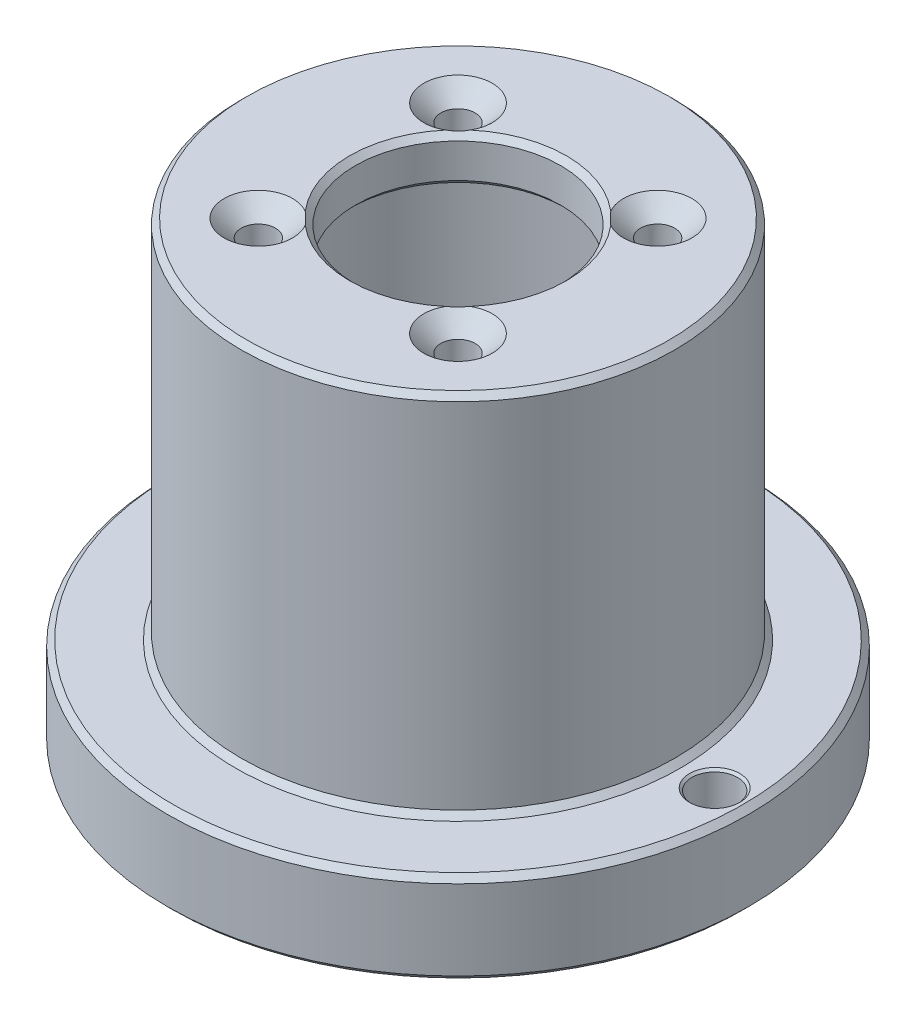
ISO-10303-21;
HEADER;
FILE_DESCRIPTION(('STEP AP214'),'2;1');
FILE_NAME('part.step','',(''),(''),'','','');
FILE_SCHEMA(('AUTOMOTIVE_DESIGN { 1 0 10303 214 1 1 1 1 }'));
ENDSEC;
DATA;
#1=APPLICATION_CONTEXT('core data for automotive mechanical design processes');
#2=APPLICATION_PROTOCOL_DEFINITION('international standard','automotive_design',2000,#1);
#3=PRODUCT_CONTEXT('',#1,'mechanical');
#4=PRODUCT('Part','Part','',(#3));
#5=PRODUCT_RELATED_PRODUCT_CATEGORY('part','',(#4));
#6=PRODUCT_DEFINITION_FORMATION('','',#4);
#7=PRODUCT_DEFINITION_CONTEXT('part definition',#1,'design');
#8=PRODUCT_DEFINITION('design','',#6,#7);
#9=PRODUCT_DEFINITION_SHAPE('','',#8);
#10=(LENGTH_UNIT() NAMED_UNIT(*) SI_UNIT(.MILLI.,.METRE.));
#11=(NAMED_UNIT(*) PLANE_ANGLE_UNIT() SI_UNIT($,.RADIAN.));
#12=(NAMED_UNIT(*) SI_UNIT($,.STERADIAN.) SOLID_ANGLE_UNIT());
#13=UNCERTAINTY_MEASURE_WITH_UNIT(LENGTH_MEASURE(1.E-05),#10,'distance_accuracy_value','');
#14=(GEOMETRIC_REPRESENTATION_CONTEXT(3) GLOBAL_UNCERTAINTY_ASSIGNED_CONTEXT((#13)) GLOBAL_UNIT_ASSIGNED_CONTEXT((#10,
#11,#12)) REPRESENTATION_CONTEXT('',''));
#15=CARTESIAN_POINT('',(0.,0.,0.));
#16=DIRECTION('',(0.,0.,1.));
#17=DIRECTION('',(1.,0.,0.));
#18=AXIS2_PLACEMENT_3D('',#15,#16,#17);
#19=CARTESIAN_POINT('',(0.,0.,0.));
#20=DIRECTION('',(0.,-1.,0.));
#21=DIRECTION('',(0.,0.,-1.));
#22=AXIS2_PLACEMENT_3D('',#19,#20,#21);
#23=CYLINDRICAL_SURFACE('',#22,15.);
#24=CARTESIAN_POINT('',(0.,0.499999999999984,0.));
#25=DIRECTION('',(0.,1.,0.));
#26=DIRECTION('',(0.,0.,1.));
#27=AXIS2_PLACEMENT_3D('',#24,#25,#26);
#28=CIRCLE('',#27,15.);
#29=CARTESIAN_POINT('',(0.,0.499999999999984,15.));
#30=VERTEX_POINT('',#29);
#31=EDGE_CURVE('E315',#30,#30,#28,.F.);
#32=ORIENTED_EDGE('',*,*,#31,.T.);
#33=EDGE_LOOP('',(#32));
#34=FACE_BOUND('',#33,.T.);
#35=CARTESIAN_POINT('',(0.,35.5,0.));
#36=DIRECTION('',(0.,1.,0.));
#37=DIRECTION('',(0.,0.,1.));
#38=AXIS2_PLACEMENT_3D('',#35,#36,#37);
#39=CIRCLE('',#38,15.);
#40=CARTESIAN_POINT('',(0.,35.5,15.));
#41=VERTEX_POINT('',#40);
#42=EDGE_CURVE('E312',#41,#41,#39,.T.);
#43=ORIENTED_EDGE('',*,*,#42,.T.);
#44=EDGE_LOOP('',(#43));
#45=FACE_BOUND('',#44,.T.);
#46=ADVANCED_FACE('F33',(#34,#45),#23,.F.);
#47=CARTESIAN_POINT('',(-15.,0.,0.));
#48=DIRECTION('',(0.,1.,0.));
#49=DIRECTION('',(0.,0.,1.));
#50=AXIS2_PLACEMENT_3D('',#47,#48,#49);
#51=PLANE('',#50);
#52=CARTESIAN_POINT('',(0.,0.,0.));
#53=DIRECTION('',(0.,1.,0.));
#54=DIRECTION('',(0.,0.,1.));
#55=AXIS2_PLACEMENT_3D('',#52,#53,#54);
#56=CIRCLE('',#55,15.5);
#57=CARTESIAN_POINT('',(0.,0.,15.5));
#58=VERTEX_POINT('',#57);
#59=EDGE_CURVE('E320',#58,#58,#56,.T.);
#60=ORIENTED_EDGE('',*,*,#59,.T.);
#61=EDGE_LOOP('',(#60));
#62=FACE_BOUND('',#61,.T.);
#63=CARTESIAN_POINT('',(0.,0.,0.));
#64=DIRECTION('',(0.,1.,0.));
#65=DIRECTION('',(0.,0.,1.));
#66=AXIS2_PLACEMENT_3D('',#63,#64,#65);
#67=CIRCLE('',#66,25.);
#68=CARTESIAN_POINT('',(0.,0.,25.));
#69=VERTEX_POINT('',#68);
#70=EDGE_CURVE('E317',#69,#69,#67,.F.);
#71=ORIENTED_EDGE('',*,*,#70,.T.);
#72=EDGE_LOOP('',(#71));
#73=FACE_BOUND('',#72,.T.);
#74=CARTESIAN_POINT('',(22.5,0.,0.));
#75=DIRECTION('',(0.,1.,0.));
#76=DIRECTION('',(0.,0.,1.));
#77=AXIS2_PLACEMENT_3D('',#74,#75,#76);
#78=CIRCLE('',#77,2.20000000000002);
#79=CARTESIAN_POINT('',(22.5,0.,2.20000000000001));
#80=VERTEX_POINT('',#79);
#81=EDGE_CURVE('E242',#80,#80,#78,.T.);
#82=ORIENTED_EDGE('',*,*,#81,.T.);
#83=EDGE_LOOP('',(#82));
#84=FACE_BOUND('',#83,.T.);
#85=CARTESIAN_POINT('',(-22.5,0.,0.));
#86=DIRECTION('',(0.,1.,0.));
#87=DIRECTION('',(0.,0.,1.));
#88=AXIS2_PLACEMENT_3D('',#85,#86,#87);
#89=CIRCLE('',#88,2.20000000000002);
#90=CARTESIAN_POINT('',(-22.5,0.,2.20000000000003));
#91=VERTEX_POINT('',#90);
#92=EDGE_CURVE('E247',#91,#91,#89,.T.);
#93=ORIENTED_EDGE('',*,*,#92,.T.);
#94=EDGE_LOOP('',(#93));
#95=FACE_BOUND('',#94,.T.);
#96=ADVANCED_FACE('F178',(#62,#73,#84,#95),#51,.F.);
#97=CARTESIAN_POINT('',(0.,0.,0.));
#98=DIRECTION('',(0.,-1.,0.));
#99=DIRECTION('',(0.,0.,-1.));
#100=AXIS2_PLACEMENT_3D('',#97,#98,#99);
#101=CYLINDRICAL_SURFACE('',#100,25.5);
#102=CARTESIAN_POINT('',(0.,0.499999999999993,0.));
#103=DIRECTION('',(0.,1.,0.));
#104=DIRECTION('',(0.,0.,1.));
#105=AXIS2_PLACEMENT_3D('',#102,#103,#104);
#106=CIRCLE('',#105,25.5);
#107=CARTESIAN_POINT('',(0.,0.499999999999993,25.5));
#108=VERTEX_POINT('',#107);
#109=EDGE_CURVE('E326',#108,#108,#106,.T.);
#110=ORIENTED_EDGE('',*,*,#109,.T.);
#111=EDGE_LOOP('',(#110));
#112=FACE_BOUND('',#111,.T.);
#113=CARTESIAN_POINT('',(0.,7.50000000000001,0.));
#114=DIRECTION('',(0.,-1.,0.));
#115=DIRECTION('',(0.,0.,-1.));
#116=AXIS2_PLACEMENT_3D('',#113,#114,#115);
#117=CIRCLE('',#116,25.5);
#118=CARTESIAN_POINT('',(0.,7.50000000000001,-25.5));
#119=VERTEX_POINT('',#118);
#120=EDGE_CURVE('E323',#119,#119,#117,.T.);
#121=ORIENTED_EDGE('',*,*,#120,.T.);
#122=EDGE_LOOP('',(#121));
#123=FACE_BOUND('',#122,.T.);
#124=ADVANCED_FACE('F183',(#112,#123),#101,.T.);
#125=CARTESIAN_POINT('',(-25.5,8.,0.));
#126=DIRECTION('',(0.,-1.,0.));
#127=DIRECTION('',(0.,0.,-1.));
#128=AXIS2_PLACEMENT_3D('',#125,#126,#127);
#129=PLANE('',#128);
#130=CARTESIAN_POINT('',(0.,8.,0.));
#131=DIRECTION('',(0.,-1.,0.));
#132=DIRECTION('',(0.,0.,-1.));
#133=AXIS2_PLACEMENT_3D('',#130,#131,#132);
#134=CIRCLE('',#133,25.);
#135=CARTESIAN_POINT('',(0.,8.,-25.));
#136=VERTEX_POINT('',#135);
#137=EDGE_CURVE('E332',#136,#136,#134,.F.);
#138=ORIENTED_EDGE('',*,*,#137,.T.);
#139=EDGE_LOOP('',(#138));
#140=FACE_BOUND('',#139,.T.);
#141=CARTESIAN_POINT('',(0.,8.,0.));
#142=DIRECTION('',(0.,-1.,0.));
#143=DIRECTION('',(0.,0.,-1.));
#144=AXIS2_PLACEMENT_3D('',#141,#142,#143);
#145=CIRCLE('',#144,19.5);
#146=CARTESIAN_POINT('',(0.,8.,-19.5));
#147=VERTEX_POINT('',#146);
#148=EDGE_CURVE('E329',#147,#147,#145,.T.);
#149=ORIENTED_EDGE('',*,*,#148,.T.);
#150=EDGE_LOOP('',(#149));
#151=FACE_BOUND('',#150,.T.);
#152=CARTESIAN_POINT('',(22.5,8.,0.));
#153=DIRECTION('',(0.,-1.,0.));
#154=DIRECTION('',(0.,0.,-1.));
#155=AXIS2_PLACEMENT_3D('',#152,#153,#154);
#156=CIRCLE('',#155,2.20000000000002);
#157=CARTESIAN_POINT('',(22.5,8.,-2.20000000000003));
#158=VERTEX_POINT('',#157);
#159=EDGE_CURVE('E253',#158,#158,#156,.T.);
#160=ORIENTED_EDGE('',*,*,#159,.T.);
#161=EDGE_LOOP('',(#160));
#162=FACE_BOUND('',#161,.T.);
#163=CARTESIAN_POINT('',(-22.5,8.,0.));
#164=DIRECTION('',(0.,-1.,0.));
#165=DIRECTION('',(0.,0.,-1.));
#166=AXIS2_PLACEMENT_3D('',#163,#164,#165);
#167=CIRCLE('',#166,2.20000000000002);
#168=CARTESIAN_POINT('',(-22.5,8.,-2.20000000000002));
#169=VERTEX_POINT('',#168);
#170=EDGE_CURVE('E244',#169,#169,#167,.T.);
#171=ORIENTED_EDGE('',*,*,#170,.T.);
#172=EDGE_LOOP('',(#171));
#173=FACE_BOUND('',#172,.T.);
#174=ADVANCED_FACE('F191',(#140,#151,#162,#173),#129,.F.);
#175=CARTESIAN_POINT('',(0.,0.,0.));
#176=DIRECTION('',(0.,-1.,0.));
#177=DIRECTION('',(0.,0.,-1.));
#178=AXIS2_PLACEMENT_3D('',#175,#176,#177);
#179=CYLINDRICAL_SURFACE('',#178,19.);
#180=CARTESIAN_POINT('',(0.,8.49999999999999,0.));
#181=DIRECTION('',(0.,-1.,0.));
#182=DIRECTION('',(0.,0.,-1.));
#183=AXIS2_PLACEMENT_3D('',#180,#181,#182);
#184=CIRCLE('',#183,19.);
#185=CARTESIAN_POINT('',(0.,8.49999999999999,-19.));
#186=VERTEX_POINT('',#185);
#187=EDGE_CURVE('E11',#186,#186,#184,.F.);
#188=ORIENTED_EDGE('',*,*,#187,.T.);
#189=EDGE_LOOP('',(#188));
#190=FACE_BOUND('',#189,.T.);
#191=CARTESIAN_POINT('',(0.,39.5,0.));
#192=DIRECTION('',(0.,-1.,0.));
#193=DIRECTION('',(0.,0.,-1.));
#194=AXIS2_PLACEMENT_3D('',#191,#192,#193);
#195=CIRCLE('',#194,19.);
#196=CARTESIAN_POINT('',(0.,39.5,-19.));
#197=VERTEX_POINT('',#196);
#198=EDGE_CURVE('E41',#197,#197,#195,.T.);
#199=ORIENTED_EDGE('',*,*,#198,.T.);
#200=EDGE_LOOP('',(#199));
#201=FACE_BOUND('',#200,.T.);
#202=ADVANCED_FACE('F195',(#190,#201),#179,.T.);
#203=CARTESIAN_POINT('',(-19.,40.,0.));
#204=DIRECTION('',(0.,-1.,0.));
#205=DIRECTION('',(0.,0.,-1.));
#206=AXIS2_PLACEMENT_3D('',#203,#204,#205);
#207=PLANE('',#206);
#208=CARTESIAN_POINT('',(0.,40.,0.));
#209=DIRECTION('',(0.,-1.,0.));
#210=DIRECTION('',(0.,0.,-1.));
#211=AXIS2_PLACEMENT_3D('',#208,#209,#210);
#212=CIRCLE('',#211,18.5);
#213=CARTESIAN_POINT('',(0.,40.,-18.5));
#214=VERTEX_POINT('',#213);
#215=EDGE_CURVE('E286',#214,#214,#212,.F.);
#216=ORIENTED_EDGE('',*,*,#215,.T.);
#217=EDGE_LOOP('',(#216));
#218=FACE_BOUND('',#217,.T.);
#219=CARTESIAN_POINT('',(8.75,40.,8.75));
#220=DIRECTION('',(0.,-1.,0.));
#221=DIRECTION('',(0.,0.,-1.));
#222=AXIS2_PLACEMENT_3D('',#219,#220,#221);
#223=CIRCLE('',#222,3.00000000000001);
#224=CARTESIAN_POINT('',(7.22825973613697,40.,6.16459740672016));
#225=VERTEX_POINT('',#224);
#226=CARTESIAN_POINT('',(6.16459740672016,40.,7.22825973613697));
#227=VERTEX_POINT('',#226);
#228=EDGE_CURVE('E86',#225,#227,#223,.T.);
#229=ORIENTED_EDGE('',*,*,#228,.T.);
#230=CARTESIAN_POINT('',(0.,40.,0.));
#231=DIRECTION('',(0.,-1.,0.));
#232=DIRECTION('',(0.,0.,-1.));
#233=AXIS2_PLACEMENT_3D('',#230,#231,#232);
#234=CIRCLE('',#233,9.49999999999999);
#235=CARTESIAN_POINT('',(-6.16459740672016,40.,7.22825973613697));
#236=VERTEX_POINT('',#235);
#237=EDGE_CURVE('E81',#227,#236,#234,.T.);
#238=ORIENTED_EDGE('',*,*,#237,.T.);
#239=CARTESIAN_POINT('',(-8.75,40.,8.75));
#240=DIRECTION('',(0.,-1.,0.));
#241=DIRECTION('',(0.,0.,-1.));
#242=AXIS2_PLACEMENT_3D('',#239,#240,#241);
#243=CIRCLE('',#242,3.00000000000001);
#244=CARTESIAN_POINT('',(-7.22825973613696,40.,6.16459740672016));
#245=VERTEX_POINT('',#244);
#246=EDGE_CURVE('E77',#236,#245,#243,.T.);
#247=ORIENTED_EDGE('',*,*,#246,.T.);
#248=CARTESIAN_POINT('',(0.,40.,0.));
#249=DIRECTION('',(0.,-1.,0.));
#250=DIRECTION('',(0.,0.,-1.));
#251=AXIS2_PLACEMENT_3D('',#248,#249,#250);
#252=CIRCLE('',#251,9.49999999999999);
#253=CARTESIAN_POINT('',(-7.22825973613696,40.,-6.16459740672016));
#254=VERTEX_POINT('',#253);
#255=EDGE_CURVE('E48',#245,#254,#252,.T.);
#256=ORIENTED_EDGE('',*,*,#255,.T.);
#257=CARTESIAN_POINT('',(-8.75,40.,-8.75));
#258=DIRECTION('',(0.,-1.,0.));
#259=DIRECTION('',(0.,0.,-1.));
#260=AXIS2_PLACEMENT_3D('',#257,#258,#259);
#261=CIRCLE('',#260,3.00000000000001);
#262=CARTESIAN_POINT('',(-6.16459740672016,40.,-7.22825973613696));
#263=VERTEX_POINT('',#262);
#264=EDGE_CURVE('E390',#254,#263,#261,.T.);
#265=ORIENTED_EDGE('',*,*,#264,.T.);
#266=CARTESIAN_POINT('',(0.,40.,0.));
#267=DIRECTION('',(0.,-1.,0.));
#268=DIRECTION('',(0.,0.,-1.));
#269=AXIS2_PLACEMENT_3D('',#266,#267,#268);
#270=CIRCLE('',#269,9.49999999999999);
#271=CARTESIAN_POINT('',(6.16459740672016,40.,-7.22825973613696));
#272=VERTEX_POINT('',#271);
#273=EDGE_CURVE('E90',#263,#272,#270,.T.);
#274=ORIENTED_EDGE('',*,*,#273,.T.);
#275=CARTESIAN_POINT('',(8.75,40.,-8.75));
#276=DIRECTION('',(0.,-1.,0.));
#277=DIRECTION('',(0.,0.,-1.));
#278=AXIS2_PLACEMENT_3D('',#275,#276,#277);
#279=CIRCLE('',#278,3.00000000000001);
#280=CARTESIAN_POINT('',(7.22825973613696,40.,-6.16459740672016));
#281=VERTEX_POINT('',#280);
#282=EDGE_CURVE('E292',#272,#281,#279,.T.);
#283=ORIENTED_EDGE('',*,*,#282,.T.);
#284=CARTESIAN_POINT('',(0.,40.,0.));
#285=DIRECTION('',(0.,-1.,0.));
#286=DIRECTION('',(0.,0.,-1.));
#287=AXIS2_PLACEMENT_3D('',#284,#285,#286);
#288=CIRCLE('',#287,9.49999999999999);
#289=EDGE_CURVE('E93',#281,#225,#288,.T.);
#290=ORIENTED_EDGE('',*,*,#289,.T.);
#291=EDGE_LOOP('',(#229,#238,#247,#256,#265,#274,#283,#290));
#292=FACE_BOUND('',#291,.T.);
#293=ADVANCED_FACE('F84',(#218,#292),#207,.F.);
#294=CARTESIAN_POINT('',(0.,0.,0.));
#295=DIRECTION('',(0.,-1.,0.));
#296=DIRECTION('',(0.,0.,-1.));
#297=AXIS2_PLACEMENT_3D('',#294,#295,#296);
#298=CYLINDRICAL_SURFACE('',#297,9.);
#299=CARTESIAN_POINT('',(0.,39.5,0.));
#300=DIRECTION('',(0.,-1.,0.));
#301=DIRECTION('',(0.,0.,-1.));
#302=AXIS2_PLACEMENT_3D('',#299,#300,#301);
#303=CIRCLE('',#302,9.);
#304=CARTESIAN_POINT('',(0.,39.5,-9.));
#305=VERTEX_POINT('',#304);
#306=EDGE_CURVE('E300',#305,#305,#303,.F.);
#307=ORIENTED_EDGE('',*,*,#306,.T.);
#308=EDGE_LOOP('',(#307));
#309=FACE_BOUND('',#308,.T.);
#310=CARTESIAN_POINT('',(0.,36.5,0.));
#311=DIRECTION('',(0.,1.,0.));
#312=DIRECTION('',(0.,0.,1.));
#313=AXIS2_PLACEMENT_3D('',#310,#311,#312);
#314=CIRCLE('',#313,9.);
#315=CARTESIAN_POINT('',(0.,36.5,9.));
#316=VERTEX_POINT('',#315);
#317=EDGE_CURVE('E298',#316,#316,#314,.F.);
#318=ORIENTED_EDGE('',*,*,#317,.T.);
#319=EDGE_LOOP('',(#318));
#320=FACE_BOUND('',#319,.T.);
#321=ADVANCED_FACE('F202',(#309,#320),#298,.F.);
#322=CARTESIAN_POINT('',(-9.,36.,0.));
#323=DIRECTION('',(0.,1.,0.));
#324=DIRECTION('',(0.,0.,1.));
#325=AXIS2_PLACEMENT_3D('',#322,#323,#324);
#326=PLANE('',#325);
#327=CARTESIAN_POINT('',(0.,36.,0.));
#328=DIRECTION('',(0.,1.,0.));
#329=DIRECTION('',(0.,0.,1.));
#330=AXIS2_PLACEMENT_3D('',#327,#328,#329);
#331=CIRCLE('',#330,9.49999999999999);
#332=CARTESIAN_POINT('',(0.,36.,9.49999999999999));
#333=VERTEX_POINT('',#332);
#334=EDGE_CURVE('E309',#333,#333,#331,.T.);
#335=ORIENTED_EDGE('',*,*,#334,.T.);
#336=EDGE_LOOP('',(#335));
#337=FACE_BOUND('',#336,.T.);
#338=CARTESIAN_POINT('',(0.,36.,0.));
#339=DIRECTION('',(0.,1.,0.));
#340=DIRECTION('',(0.,0.,1.));
#341=AXIS2_PLACEMENT_3D('',#338,#339,#340);
#342=CIRCLE('',#341,14.5);
#343=CARTESIAN_POINT('',(0.,36.,14.5));
#344=VERTEX_POINT('',#343);
#345=EDGE_CURVE('E304',#344,#344,#342,.F.);
#346=ORIENTED_EDGE('',*,*,#345,.T.);
#347=EDGE_LOOP('',(#346));
#348=FACE_BOUND('',#347,.T.);
#349=CARTESIAN_POINT('',(-8.75,36.,8.75));
#350=DIRECTION('',(0.,1.,0.));
#351=DIRECTION('',(0.,0.,1.));
#352=AXIS2_PLACEMENT_3D('',#349,#350,#351);
#353=CIRCLE('',#352,1.69999999999999);
#354=CARTESIAN_POINT('',(-8.75,36.,10.45));
#355=VERTEX_POINT('',#354);
#356=EDGE_CURVE('E265',#355,#355,#353,.T.);
#357=ORIENTED_EDGE('',*,*,#356,.T.);
#358=EDGE_LOOP('',(#357));
#359=FACE_BOUND('',#358,.T.);
#360=CARTESIAN_POINT('',(8.75,36.,8.75));
#361=DIRECTION('',(0.,1.,0.));
#362=DIRECTION('',(0.,0.,1.));
#363=AXIS2_PLACEMENT_3D('',#360,#361,#362);
#364=CIRCLE('',#363,1.70000000000001);
#365=CARTESIAN_POINT('',(8.75,36.,10.45));
#366=VERTEX_POINT('',#365);
#367=EDGE_CURVE('E262',#366,#366,#364,.T.);
#368=ORIENTED_EDGE('',*,*,#367,.T.);
#369=EDGE_LOOP('',(#368));
#370=FACE_BOUND('',#369,.T.);
#371=CARTESIAN_POINT('',(8.75,36.,-8.75));
#372=DIRECTION('',(0.,1.,0.));
#373=DIRECTION('',(0.,0.,1.));
#374=AXIS2_PLACEMENT_3D('',#371,#372,#373);
#375=CIRCLE('',#374,1.70000000000001);
#376=CARTESIAN_POINT('',(8.75,36.,-7.04999999999999));
#377=VERTEX_POINT('',#376);
#378=EDGE_CURVE('E259',#377,#377,#375,.T.);
#379=ORIENTED_EDGE('',*,*,#378,.T.);
#380=EDGE_LOOP('',(#379));
#381=FACE_BOUND('',#380,.T.);
#382=CARTESIAN_POINT('',(-8.75,36.,-8.75));
#383=DIRECTION('',(0.,1.,0.));
#384=DIRECTION('',(0.,0.,1.));
#385=AXIS2_PLACEMENT_3D('',#382,#383,#384);
#386=CIRCLE('',#385,1.70000000000001);
#387=CARTESIAN_POINT('',(-8.75,36.,-7.04999999999999));
#388=VERTEX_POINT('',#387);
#389=EDGE_CURVE('E256',#388,#388,#386,.T.);
#390=ORIENTED_EDGE('',*,*,#389,.T.);
#391=EDGE_LOOP('',(#390));
#392=FACE_BOUND('',#391,.T.);
#393=ADVANCED_FACE('F206',(#337,#348,#359,#370,#381,#392),#326,.F.);
#394=CARTESIAN_POINT('',(-8.75,30.,-8.75));
#395=DIRECTION('',(0.,1.,0.));
#396=DIRECTION('',(0.,0.,1.));
#397=AXIS2_PLACEMENT_3D('',#394,#395,#396);
#398=CYLINDRICAL_SURFACE('',#397,1.5);
#399=CARTESIAN_POINT('',(-8.75,36.2,-8.75));
#400=DIRECTION('',(0.,1.,0.));
#401=DIRECTION('',(0.,0.,1.));
#402=AXIS2_PLACEMENT_3D('',#399,#400,#401);
#403=CIRCLE('',#402,1.5);
#404=CARTESIAN_POINT('',(-8.75,36.2,-7.25));
#405=VERTEX_POINT('',#404);
#406=EDGE_CURVE('E277',#405,#405,#403,.F.);
#407=ORIENTED_EDGE('',*,*,#406,.T.);
#408=EDGE_LOOP('',(#407));
#409=FACE_BOUND('',#408,.T.);
#410=CARTESIAN_POINT('',(-8.75,38.5,-8.75));
#411=DIRECTION('',(0.,-1.,0.));
#412=DIRECTION('',(0.,0.,-1.));
#413=AXIS2_PLACEMENT_3D('',#410,#411,#412);
#414=CIRCLE('',#413,1.5);
#415=CARTESIAN_POINT('',(-8.75,38.5,-10.25));
#416=VERTEX_POINT('',#415);
#417=EDGE_CURVE('E380',#416,#416,#414,.F.);
#418=ORIENTED_EDGE('',*,*,#417,.T.);
#419=EDGE_LOOP('',(#418));
#420=FACE_BOUND('',#419,.T.);
#421=ADVANCED_FACE('F210',(#409,#420),#398,.F.);
#422=CARTESIAN_POINT('',(-8.75,30.,8.75));
#423=DIRECTION('',(0.,1.,0.));
#424=DIRECTION('',(0.,0.,1.));
#425=AXIS2_PLACEMENT_3D('',#422,#423,#424);
#426=CYLINDRICAL_SURFACE('',#425,1.5);
#427=CARTESIAN_POINT('',(-8.75,36.2,8.75));
#428=DIRECTION('',(0.,1.,0.));
#429=DIRECTION('',(0.,0.,1.));
#430=AXIS2_PLACEMENT_3D('',#427,#428,#429);
#431=CIRCLE('',#430,1.5);
#432=CARTESIAN_POINT('',(-8.75,36.2,10.25));
#433=VERTEX_POINT('',#432);
#434=EDGE_CURVE('E268',#433,#433,#431,.F.);
#435=ORIENTED_EDGE('',*,*,#434,.T.);
#436=EDGE_LOOP('',(#435));
#437=FACE_BOUND('',#436,.T.);
#438=CARTESIAN_POINT('',(-8.75,38.5,8.75));
#439=DIRECTION('',(0.,-1.,0.));
#440=DIRECTION('',(0.,0.,-1.));
#441=AXIS2_PLACEMENT_3D('',#438,#439,#440);
#442=CIRCLE('',#441,1.5);
#443=CARTESIAN_POINT('',(-8.75,38.5,7.25));
#444=VERTEX_POINT('',#443);
#445=EDGE_CURVE('E392',#444,#444,#442,.F.);
#446=ORIENTED_EDGE('',*,*,#445,.T.);
#447=EDGE_LOOP('',(#446));
#448=FACE_BOUND('',#447,.T.);
#449=ADVANCED_FACE('F214',(#437,#448),#426,.F.);
#450=CARTESIAN_POINT('',(8.75,30.,8.75));
#451=DIRECTION('',(0.,1.,0.));
#452=DIRECTION('',(0.,0.,1.));
#453=AXIS2_PLACEMENT_3D('',#450,#451,#452);
#454=CYLINDRICAL_SURFACE('',#453,1.5);
#455=CARTESIAN_POINT('',(8.75,36.2,8.75));
#456=DIRECTION('',(0.,1.,0.));
#457=DIRECTION('',(0.,0.,1.));
#458=AXIS2_PLACEMENT_3D('',#455,#456,#457);
#459=CIRCLE('',#458,1.5);
#460=CARTESIAN_POINT('',(8.75,36.2,10.25));
#461=VERTEX_POINT('',#460);
#462=EDGE_CURVE('E271',#461,#461,#459,.F.);
#463=ORIENTED_EDGE('',*,*,#462,.T.);
#464=EDGE_LOOP('',(#463));
#465=FACE_BOUND('',#464,.T.);
#466=CARTESIAN_POINT('',(8.75,38.5,8.75));
#467=DIRECTION('',(0.,-1.,0.));
#468=DIRECTION('',(0.,0.,-1.));
#469=AXIS2_PLACEMENT_3D('',#466,#467,#468);
#470=CIRCLE('',#469,1.5);
#471=CARTESIAN_POINT('',(8.75,38.5,7.25));
#472=VERTEX_POINT('',#471);
#473=EDGE_CURVE('E85',#472,#472,#470,.F.);
#474=ORIENTED_EDGE('',*,*,#473,.T.);
#475=EDGE_LOOP('',(#474));
#476=FACE_BOUND('',#475,.T.);
#477=ADVANCED_FACE('F218',(#465,#476),#454,.F.);
#478=CARTESIAN_POINT('',(8.75,30.,-8.75));
#479=DIRECTION('',(0.,1.,0.));
#480=DIRECTION('',(0.,0.,1.));
#481=AXIS2_PLACEMENT_3D('',#478,#479,#480);
#482=CYLINDRICAL_SURFACE('',#481,1.5);
#483=CARTESIAN_POINT('',(8.75,36.2,-8.75));
#484=DIRECTION('',(0.,1.,0.));
#485=DIRECTION('',(0.,0.,1.));
#486=AXIS2_PLACEMENT_3D('',#483,#484,#485);
#487=CIRCLE('',#486,1.5);
#488=CARTESIAN_POINT('',(8.75,36.2,-7.25));
#489=VERTEX_POINT('',#488);
#490=EDGE_CURVE('E274',#489,#489,#487,.F.);
#491=ORIENTED_EDGE('',*,*,#490,.T.);
#492=EDGE_LOOP('',(#491));
#493=FACE_BOUND('',#492,.T.);
#494=CARTESIAN_POINT('',(8.75,38.5,-8.75));
#495=DIRECTION('',(0.,-1.,0.));
#496=DIRECTION('',(0.,0.,-1.));
#497=AXIS2_PLACEMENT_3D('',#494,#495,#496);
#498=CIRCLE('',#497,1.5);
#499=CARTESIAN_POINT('',(8.75,38.5,-10.25));
#500=VERTEX_POINT('',#499);
#501=EDGE_CURVE('E382',#500,#500,#498,.F.);
#502=ORIENTED_EDGE('',*,*,#501,.T.);
#503=EDGE_LOOP('',(#502));
#504=FACE_BOUND('',#503,.T.);
#505=ADVANCED_FACE('F222',(#493,#504),#482,.F.);
#506=CARTESIAN_POINT('',(-8.75,38.5,8.75));
#507=DIRECTION('',(0.,1.,0.));
#508=DIRECTION('',(0.,0.,1.));
#509=AXIS2_PLACEMENT_3D('',#506,#507,#508);
#510=CONICAL_SURFACE('',#509,1.5,0.785398163397451);
#511=ORIENTED_EDGE('',*,*,#246,.F.);
#512=CARTESIAN_POINT('',(-6.16459740672016,40.,7.22825973613697));
#513=CARTESIAN_POINT('',(-6.20476141220548,39.9896540959761,7.18041020194915));
#514=CARTESIAN_POINT('',(-6.2455590811111,39.9805300766451,7.13283469011282));
#515=CARTESIAN_POINT('',(-6.32838670290927,39.9648153878851,7.0383332995226));
#516=CARTESIAN_POINT('',(-6.3704168010074,39.9582250182735,6.99140749828469));
#517=CARTESIAN_POINT('',(-6.49751455912726,39.9424878913398,6.85261930301328));
#518=CARTESIAN_POINT('',(-6.58432085288477,39.9371843353823,6.76187322482778));
#519=CARTESIAN_POINT('',(-6.76187322482778,39.9371843353823,6.58432085288477));
#520=CARTESIAN_POINT('',(-6.85261930301328,39.9424878913398,6.49751455912726));
#521=CARTESIAN_POINT('',(-6.99140749828468,39.9582250182735,6.3704168010074));
#522=CARTESIAN_POINT('',(-7.0383332995226,39.9648153878851,6.32838670290927));
#523=CARTESIAN_POINT('',(-7.13283469011282,39.9805300766451,6.2455590811111));
#524=CARTESIAN_POINT('',(-7.18041020194915,39.9896540959761,6.20476141220548));
#525=CARTESIAN_POINT('',(-7.22825973613696,40.,6.16459740672016));
#526=B_SPLINE_CURVE_WITH_KNOTS('',3,(#512,#513,#514,#515,#516,#517,#518,#519,#520,#521,#522,
#523,#524,#525),.UNSPECIFIED.,.F.,.F.,(4,2,2,2,2,2,4),(0.,0.189940737532675,0.379903944641558,
0.756380339433058,1.13285673422456,1.32281994133344,1.51276067886612),.UNSPECIFIED.);
#527=EDGE_CURVE('E74',#236,#245,#526,.T.);
#528=ORIENTED_EDGE('',*,*,#527,.T.);
#529=EDGE_LOOP('',(#511,#528));
#530=FACE_BOUND('',#529,.T.);
#531=ORIENTED_EDGE('',*,*,#445,.F.);
#532=EDGE_LOOP('',(#531));
#533=FACE_BOUND('',#532,.T.);
#534=ADVANCED_FACE('F75',(#530,#533),#510,.F.);
#535=CARTESIAN_POINT('',(8.75,38.5,8.75));
#536=DIRECTION('',(0.,1.,0.));
#537=DIRECTION('',(0.,0.,1.));
#538=AXIS2_PLACEMENT_3D('',#535,#536,#537);
#539=CONICAL_SURFACE('',#538,1.5,0.785398163397451);
#540=ORIENTED_EDGE('',*,*,#228,.F.);
#541=CARTESIAN_POINT('',(7.22825973613697,40.,6.16459740672016));
#542=CARTESIAN_POINT('',(7.18041020194915,39.9896540959761,6.20476141220547));
#543=CARTESIAN_POINT('',(7.13283469011282,39.9805300766451,6.2455590811111));
#544=CARTESIAN_POINT('',(7.0383332995226,39.9648153878851,6.32838670290927));
#545=CARTESIAN_POINT('',(6.99140749828469,39.9582250182735,6.37041680100739));
#546=CARTESIAN_POINT('',(6.85261930301328,39.9424878913398,6.49751455912726));
#547=CARTESIAN_POINT('',(6.76187322482778,39.9371843353823,6.58432085288476));
#548=CARTESIAN_POINT('',(6.58432085288476,39.9371843353823,6.76187322482778));
#549=CARTESIAN_POINT('',(6.49751455912726,39.9424878913398,6.85261930301328));
#550=CARTESIAN_POINT('',(6.3704168010074,39.9582250182735,6.99140749828469));
#551=CARTESIAN_POINT('',(6.32838670290927,39.9648153878851,7.0383332995226));
#552=CARTESIAN_POINT('',(6.2455590811111,39.9805300766451,7.13283469011282));
#553=CARTESIAN_POINT('',(6.20476141220547,39.9896540959761,7.18041020194915));
#554=CARTESIAN_POINT('',(6.16459740672016,40.,7.22825973613697));
#555=B_SPLINE_CURVE_WITH_KNOTS('',3,(#541,#542,#543,#544,#545,#546,#547,#548,#549,#550,#551,
#552,#553,#554),.UNSPECIFIED.,.F.,.F.,(4,2,2,2,2,2,4),(0.,0.189940737532677,0.379903944641561,
0.756380339433064,1.13285673422457,1.32281994133345,1.51276067886613),.UNSPECIFIED.);
#556=EDGE_CURVE('E128',#225,#227,#555,.T.);
#557=ORIENTED_EDGE('',*,*,#556,.T.);
#558=EDGE_LOOP('',(#540,#557));
#559=FACE_BOUND('',#558,.T.);
#560=ORIENTED_EDGE('',*,*,#473,.F.);
#561=EDGE_LOOP('',(#560));
#562=FACE_BOUND('',#561,.T.);
#563=ADVANCED_FACE('F137',(#559,#562),#539,.F.);
#564=CARTESIAN_POINT('',(8.75,38.5,-8.75));
#565=DIRECTION('',(0.,1.,0.));
#566=DIRECTION('',(0.,0.,1.));
#567=AXIS2_PLACEMENT_3D('',#564,#565,#566);
#568=CONICAL_SURFACE('',#567,1.5,0.78539816339745);
#569=ORIENTED_EDGE('',*,*,#282,.F.);
#570=CARTESIAN_POINT('',(6.16459740672016,40.,-7.22825973613696));
#571=CARTESIAN_POINT('',(6.20476141220548,39.9896540959761,-7.18041020194915));
#572=CARTESIAN_POINT('',(6.2455590811111,39.9805300766451,-7.13283469011282));
#573=CARTESIAN_POINT('',(6.32838670290927,39.9648153878851,-7.0383332995226));
#574=CARTESIAN_POINT('',(6.3704168010074,39.9582250182735,-6.99140749828468));
#575=CARTESIAN_POINT('',(6.49751455912726,39.9424878913398,-6.85261930301328));
#576=CARTESIAN_POINT('',(6.58432085288477,39.9371843353823,-6.76187322482778));
#577=CARTESIAN_POINT('',(6.76187322482778,39.9371843353823,-6.58432085288477));
#578=CARTESIAN_POINT('',(6.85261930301328,39.9424878913398,-6.49751455912726));
#579=CARTESIAN_POINT('',(6.99140749828468,39.9582250182735,-6.3704168010074));
#580=CARTESIAN_POINT('',(7.0383332995226,39.9648153878851,-6.32838670290927));
#581=CARTESIAN_POINT('',(7.13283469011282,39.9805300766451,-6.2455590811111));
#582=CARTESIAN_POINT('',(7.18041020194915,39.9896540959761,-6.20476141220548));
#583=CARTESIAN_POINT('',(7.22825973613696,40.,-6.16459740672016));
#584=B_SPLINE_CURVE_WITH_KNOTS('',3,(#570,#571,#572,#573,#574,#575,#576,#577,#578,#579,#580,
#581,#582,#583),.UNSPECIFIED.,.F.,.F.,(4,2,2,2,2,2,4),(0.,0.189940737532674,0.379903944641558,
0.756380339433058,1.13285673422456,1.32281994133344,1.51276067886611),.UNSPECIFIED.);
#585=EDGE_CURVE('E123',#272,#281,#584,.T.);
#586=ORIENTED_EDGE('',*,*,#585,.T.);
#587=EDGE_LOOP('',(#569,#586));
#588=FACE_BOUND('',#587,.T.);
#589=ORIENTED_EDGE('',*,*,#501,.F.);
#590=EDGE_LOOP('',(#589));
#591=FACE_BOUND('',#590,.T.);
#592=ADVANCED_FACE('F133',(#588,#591),#568,.F.);
#593=CARTESIAN_POINT('',(-8.75,38.5,-8.75));
#594=DIRECTION('',(0.,1.,0.));
#595=DIRECTION('',(0.,0.,1.));
#596=AXIS2_PLACEMENT_3D('',#593,#594,#595);
#597=CONICAL_SURFACE('',#596,1.5,0.78539816339745);
#598=ORIENTED_EDGE('',*,*,#264,.F.);
#599=CARTESIAN_POINT('',(-7.22825973613696,40.,-6.16459740672016));
#600=CARTESIAN_POINT('',(-7.18041020194915,39.9896540959761,-6.20476141220548));
#601=CARTESIAN_POINT('',(-7.13283469011282,39.9805300766451,-6.2455590811111));
#602=CARTESIAN_POINT('',(-7.0383332995226,39.9648153878851,-6.32838670290927));
#603=CARTESIAN_POINT('',(-6.99140749828468,39.9582250182735,-6.3704168010074));
#604=CARTESIAN_POINT('',(-6.85261930301328,39.9424878913398,-6.49751455912726));
#605=CARTESIAN_POINT('',(-6.76187322482778,39.9371843353823,-6.58432085288476));
#606=CARTESIAN_POINT('',(-6.58432085288477,39.9371843353823,-6.76187322482778));
#607=CARTESIAN_POINT('',(-6.49751455912726,39.9424878913398,-6.85261930301328));
#608=CARTESIAN_POINT('',(-6.3704168010074,39.9582250182735,-6.99140749828468));
#609=CARTESIAN_POINT('',(-6.32838670290927,39.9648153878851,-7.0383332995226));
#610=CARTESIAN_POINT('',(-6.2455590811111,39.9805300766451,-7.13283469011282));
#611=CARTESIAN_POINT('',(-6.20476141220548,39.9896540959761,-7.18041020194915));
#612=CARTESIAN_POINT('',(-6.16459740672017,40.,-7.22825973613696));
#613=B_SPLINE_CURVE_WITH_KNOTS('',3,(#599,#600,#601,#602,#603,#604,#605,#606,#607,#608,#609,
#610,#611,#612),.UNSPECIFIED.,.F.,.F.,(4,2,2,2,2,2,4),(0.,0.189940737532674,0.379903944641557,
0.756380339433056,1.13285673422455,1.32281994133344,1.51276067886611),.UNSPECIFIED.);
#614=EDGE_CURVE('E54',#254,#263,#613,.T.);
#615=ORIENTED_EDGE('',*,*,#614,.T.);
#616=EDGE_LOOP('',(#598,#615));
#617=FACE_BOUND('',#616,.T.);
#618=ORIENTED_EDGE('',*,*,#417,.F.);
#619=EDGE_LOOP('',(#618));
#620=FACE_BOUND('',#619,.T.);
#621=ADVANCED_FACE('F136',(#617,#620),#597,.F.);
#622=CARTESIAN_POINT('',(-22.5,-2.,0.));
#623=DIRECTION('',(0.,1.,0.));
#624=DIRECTION('',(0.,0.,1.));
#625=AXIS2_PLACEMENT_3D('',#622,#623,#624);
#626=CYLINDRICAL_SURFACE('',#625,2.);
#627=CARTESIAN_POINT('',(-22.5,7.79999999999998,0.));
#628=DIRECTION('',(0.,-1.,0.));
#629=DIRECTION('',(0.,0.,-1.));
#630=AXIS2_PLACEMENT_3D('',#627,#628,#629);
#631=CIRCLE('',#630,2.);
#632=CARTESIAN_POINT('',(-22.5,7.79999999999998,-2.));
#633=VERTEX_POINT('',#632);
#634=EDGE_CURVE('E283',#633,#633,#631,.F.);
#635=ORIENTED_EDGE('',*,*,#634,.T.);
#636=EDGE_LOOP('',(#635));
#637=FACE_BOUND('',#636,.T.);
#638=CARTESIAN_POINT('',(-22.5,0.20000000000002,0.));
#639=DIRECTION('',(0.,1.,0.));
#640=DIRECTION('',(0.,0.,1.));
#641=AXIS2_PLACEMENT_3D('',#638,#639,#640);
#642=CIRCLE('',#641,2.);
#643=CARTESIAN_POINT('',(-22.5,0.20000000000002,2.00000000000001));
#644=VERTEX_POINT('',#643);
#645=EDGE_CURVE('E280',#644,#644,#642,.F.);
#646=ORIENTED_EDGE('',*,*,#645,.T.);
#647=EDGE_LOOP('',(#646));
#648=FACE_BOUND('',#647,.T.);
#649=ADVANCED_FACE('F143',(#637,#648),#626,.F.);
#650=CARTESIAN_POINT('',(22.5,-2.,0.));
#651=DIRECTION('',(0.,1.,0.));
#652=DIRECTION('',(0.,0.,1.));
#653=AXIS2_PLACEMENT_3D('',#650,#651,#652);
#654=CYLINDRICAL_SURFACE('',#653,2.);
#655=CARTESIAN_POINT('',(22.5,0.20000000000002,0.));
#656=DIRECTION('',(0.,1.,0.));
#657=DIRECTION('',(0.,0.,1.));
#658=AXIS2_PLACEMENT_3D('',#655,#656,#657);
#659=CIRCLE('',#658,2.);
#660=CARTESIAN_POINT('',(22.5,0.20000000000002,1.99999999999999));
#661=VERTEX_POINT('',#660);
#662=EDGE_CURVE('E237',#661,#661,#659,.F.);
#663=ORIENTED_EDGE('',*,*,#662,.T.);
#664=EDGE_LOOP('',(#663));
#665=FACE_BOUND('',#664,.T.);
#666=CARTESIAN_POINT('',(22.5,7.79999999999998,0.));
#667=DIRECTION('',(0.,-1.,0.));
#668=DIRECTION('',(0.,0.,-1.));
#669=AXIS2_PLACEMENT_3D('',#666,#667,#668);
#670=CIRCLE('',#669,2.);
#671=CARTESIAN_POINT('',(22.5,7.79999999999998,-2.00000000000001));
#672=VERTEX_POINT('',#671);
#673=EDGE_CURVE('E240',#672,#672,#670,.F.);
#674=ORIENTED_EDGE('',*,*,#673,.T.);
#675=EDGE_LOOP('',(#674));
#676=FACE_BOUND('',#675,.T.);
#677=ADVANCED_FACE('F148',(#665,#676),#654,.F.);
#678=CARTESIAN_POINT('',(22.5,0.,0.));
#679=DIRECTION('',(0.,-1.,0.));
#680=DIRECTION('',(0.,0.,-1.));
#681=AXIS2_PLACEMENT_3D('',#678,#679,#680);
#682=CONICAL_SURFACE('',#681,2.20000000000002,0.785398163397442);
#683=ORIENTED_EDGE('',*,*,#662,.F.);
#684=EDGE_LOOP('',(#683));
#685=FACE_BOUND('',#684,.T.);
#686=ORIENTED_EDGE('',*,*,#81,.F.);
#687=EDGE_LOOP('',(#686));
#688=FACE_BOUND('',#687,.T.);
#689=ADVANCED_FACE('F144',(#685,#688),#682,.F.);
#690=CARTESIAN_POINT('',(22.5,7.79999999999998,0.));
#691=DIRECTION('',(0.,1.,0.));
#692=DIRECTION('',(0.,0.,1.));
#693=AXIS2_PLACEMENT_3D('',#690,#691,#692);
#694=CONICAL_SURFACE('',#693,2.,0.785398163397449);
#695=ORIENTED_EDGE('',*,*,#159,.F.);
#696=EDGE_LOOP('',(#695));
#697=FACE_BOUND('',#696,.T.);
#698=ORIENTED_EDGE('',*,*,#673,.F.);
#699=EDGE_LOOP('',(#698));
#700=FACE_BOUND('',#699,.T.);
#701=ADVANCED_FACE('F147',(#697,#700),#694,.F.);
#702=CARTESIAN_POINT('',(-8.75,36.,8.75));
#703=DIRECTION('',(0.,-1.,0.));
#704=DIRECTION('',(0.,0.,-1.));
#705=AXIS2_PLACEMENT_3D('',#702,#703,#704);
#706=CONICAL_SURFACE('',#705,1.69999999999999,0.785398163397433);
#707=ORIENTED_EDGE('',*,*,#434,.F.);
#708=EDGE_LOOP('',(#707));
#709=FACE_BOUND('',#708,.T.);
#710=ORIENTED_EDGE('',*,*,#356,.F.);
#711=EDGE_LOOP('',(#710));
#712=FACE_BOUND('',#711,.T.);
#713=ADVANCED_FACE('F152',(#709,#712),#706,.F.);
#714=CARTESIAN_POINT('',(8.75,36.,8.75));
#715=DIRECTION('',(0.,-1.,0.));
#716=DIRECTION('',(0.,0.,-1.));
#717=AXIS2_PLACEMENT_3D('',#714,#715,#716);
#718=CONICAL_SURFACE('',#717,1.70000000000001,0.785398163397432);
#719=ORIENTED_EDGE('',*,*,#462,.F.);
#720=EDGE_LOOP('',(#719));
#721=FACE_BOUND('',#720,.T.);
#722=ORIENTED_EDGE('',*,*,#367,.F.);
#723=EDGE_LOOP('',(#722));
#724=FACE_BOUND('',#723,.T.);
#725=ADVANCED_FACE('F156',(#721,#724),#718,.F.);
#726=CARTESIAN_POINT('',(8.75,36.,-8.75));
#727=DIRECTION('',(0.,-1.,0.));
#728=DIRECTION('',(0.,0.,-1.));
#729=AXIS2_PLACEMENT_3D('',#726,#727,#728);
#730=CONICAL_SURFACE('',#729,1.70000000000001,0.785398163397476);
#731=ORIENTED_EDGE('',*,*,#490,.F.);
#732=EDGE_LOOP('',(#731));
#733=FACE_BOUND('',#732,.T.);
#734=ORIENTED_EDGE('',*,*,#378,.F.);
#735=EDGE_LOOP('',(#734));
#736=FACE_BOUND('',#735,.T.);
#737=ADVANCED_FACE('F160',(#733,#736),#730,.F.);
#738=CARTESIAN_POINT('',(-8.75,36.,-8.75));
#739=DIRECTION('',(0.,-1.,0.));
#740=DIRECTION('',(0.,0.,-1.));
#741=AXIS2_PLACEMENT_3D('',#738,#739,#740);
#742=CONICAL_SURFACE('',#741,1.70000000000001,0.785398163397463);
#743=ORIENTED_EDGE('',*,*,#406,.F.);
#744=EDGE_LOOP('',(#743));
#745=FACE_BOUND('',#744,.T.);
#746=ORIENTED_EDGE('',*,*,#389,.F.);
#747=EDGE_LOOP('',(#746));
#748=FACE_BOUND('',#747,.T.);
#749=ADVANCED_FACE('F164',(#745,#748),#742,.F.);
#750=CARTESIAN_POINT('',(-22.5,7.79999999999998,0.));
#751=DIRECTION('',(0.,1.,0.));
#752=DIRECTION('',(0.,0.,1.));
#753=AXIS2_PLACEMENT_3D('',#750,#751,#752);
#754=CONICAL_SURFACE('',#753,2.,0.785398163397449);
#755=ORIENTED_EDGE('',*,*,#170,.F.);
#756=EDGE_LOOP('',(#755));
#757=FACE_BOUND('',#756,.T.);
#758=ORIENTED_EDGE('',*,*,#634,.F.);
#759=EDGE_LOOP('',(#758));
#760=FACE_BOUND('',#759,.T.);
#761=ADVANCED_FACE('F167',(#757,#760),#754,.F.);
#762=CARTESIAN_POINT('',(-22.5,0.,0.));
#763=DIRECTION('',(0.,-1.,0.));
#764=DIRECTION('',(0.,0.,-1.));
#765=AXIS2_PLACEMENT_3D('',#762,#763,#764);
#766=CONICAL_SURFACE('',#765,2.20000000000002,0.785398163397442);
#767=ORIENTED_EDGE('',*,*,#645,.F.);
#768=EDGE_LOOP('',(#767));
#769=FACE_BOUND('',#768,.T.);
#770=ORIENTED_EDGE('',*,*,#92,.F.);
#771=EDGE_LOOP('',(#770));
#772=FACE_BOUND('',#771,.T.);
#773=ADVANCED_FACE('F115',(#769,#772),#766,.F.);
#774=CARTESIAN_POINT('',(0.,40.,0.));
#775=DIRECTION('',(0.,1.,0.));
#776=DIRECTION('',(0.,0.,1.));
#777=AXIS2_PLACEMENT_3D('',#774,#775,#776);
#778=CONICAL_SURFACE('',#777,9.49999999999999,0.785398163397448);
#779=ORIENTED_EDGE('',*,*,#306,.F.);
#780=EDGE_LOOP('',(#779));
#781=FACE_BOUND('',#780,.T.);
#782=ORIENTED_EDGE('',*,*,#527,.F.);
#783=ORIENTED_EDGE('',*,*,#237,.F.);
#784=ORIENTED_EDGE('',*,*,#556,.F.);
#785=ORIENTED_EDGE('',*,*,#289,.F.);
#786=ORIENTED_EDGE('',*,*,#585,.F.);
#787=ORIENTED_EDGE('',*,*,#273,.F.);
#788=ORIENTED_EDGE('',*,*,#614,.F.);
#789=ORIENTED_EDGE('',*,*,#255,.F.);
#790=EDGE_LOOP('',(#782,#783,#784,#785,#786,#787,#788,#789));
#791=FACE_BOUND('',#790,.T.);
#792=ADVANCED_FACE('F88',(#781,#791),#778,.F.);
#793=CARTESIAN_POINT('',(0.,36.5,0.));
#794=DIRECTION('',(0.,-1.,0.));
#795=DIRECTION('',(0.,0.,-1.));
#796=AXIS2_PLACEMENT_3D('',#793,#794,#795);
#797=CONICAL_SURFACE('',#796,9.,0.785398163397441);
#798=ORIENTED_EDGE('',*,*,#334,.F.);
#799=EDGE_LOOP('',(#798));
#800=FACE_BOUND('',#799,.T.);
#801=ORIENTED_EDGE('',*,*,#317,.F.);
#802=EDGE_LOOP('',(#801));
#803=FACE_BOUND('',#802,.T.);
#804=ADVANCED_FACE('F114',(#800,#803),#797,.F.);
#805=CARTESIAN_POINT('',(0.,0.499999999999984,0.));
#806=DIRECTION('',(0.,-1.,0.));
#807=DIRECTION('',(0.,0.,-1.));
#808=AXIS2_PLACEMENT_3D('',#805,#806,#807);
#809=CONICAL_SURFACE('',#808,15.,0.785398163397459);
#810=ORIENTED_EDGE('',*,*,#59,.F.);
#811=EDGE_LOOP('',(#810));
#812=FACE_BOUND('',#811,.T.);
#813=ORIENTED_EDGE('',*,*,#31,.F.);
#814=EDGE_LOOP('',(#813));
#815=FACE_BOUND('',#814,.T.);
#816=ADVANCED_FACE('F361',(#812,#815),#809,.F.);
#817=CARTESIAN_POINT('',(0.,36.,0.));
#818=DIRECTION('',(0.,-1.,0.));
#819=DIRECTION('',(0.,0.,-1.));
#820=AXIS2_PLACEMENT_3D('',#817,#818,#819);
#821=CONICAL_SURFACE('',#820,14.5,0.785398163397462);
#822=ORIENTED_EDGE('',*,*,#42,.F.);
#823=EDGE_LOOP('',(#822));
#824=FACE_BOUND('',#823,.T.);
#825=ORIENTED_EDGE('',*,*,#345,.F.);
#826=EDGE_LOOP('',(#825));
#827=FACE_BOUND('',#826,.T.);
#828=ADVANCED_FACE('F358',(#824,#827),#821,.F.);
#829=CARTESIAN_POINT('',(0.,0.,0.));
#830=DIRECTION('',(0.,1.,0.));
#831=DIRECTION('',(0.,0.,1.));
#832=AXIS2_PLACEMENT_3D('',#829,#830,#831);
#833=CONICAL_SURFACE('',#832,25.,0.785398163397431);
#834=ORIENTED_EDGE('',*,*,#109,.F.);
#835=EDGE_LOOP('',(#834));
#836=FACE_BOUND('',#835,.T.);
#837=ORIENTED_EDGE('',*,*,#70,.F.);
#838=EDGE_LOOP('',(#837));
#839=FACE_BOUND('',#838,.T.);
#840=ADVANCED_FACE('F350',(#836,#839),#833,.T.);
#841=CARTESIAN_POINT('',(0.,7.50000000000001,0.));
#842=DIRECTION('',(0.,-1.,0.));
#843=DIRECTION('',(0.,0.,-1.));
#844=AXIS2_PLACEMENT_3D('',#841,#842,#843);
#845=CONICAL_SURFACE('',#844,25.5,0.785398163397452);
#846=ORIENTED_EDGE('',*,*,#137,.F.);
#847=EDGE_LOOP('',(#846));
#848=FACE_BOUND('',#847,.T.);
#849=ORIENTED_EDGE('',*,*,#120,.F.);
#850=EDGE_LOOP('',(#849));
#851=FACE_BOUND('',#850,.T.);
#852=ADVANCED_FACE('F344',(#848,#851),#845,.T.);
#853=CARTESIAN_POINT('',(0.,8.,0.));
#854=DIRECTION('',(0.,-1.,0.));
#855=DIRECTION('',(0.,0.,-1.));
#856=AXIS2_PLACEMENT_3D('',#853,#854,#855);
#857=CONICAL_SURFACE('',#856,19.5,0.785398163397455);
#858=ORIENTED_EDGE('',*,*,#187,.F.);
#859=EDGE_LOOP('',(#858));
#860=FACE_BOUND('',#859,.T.);
#861=ORIENTED_EDGE('',*,*,#148,.F.);
#862=EDGE_LOOP('',(#861));
#863=FACE_BOUND('',#862,.T.);
#864=ADVANCED_FACE('F339',(#860,#863),#857,.T.);
#865=CARTESIAN_POINT('',(0.,39.5,0.));
#866=DIRECTION('',(0.,-1.,0.));
#867=DIRECTION('',(0.,0.,-1.));
#868=AXIS2_PLACEMENT_3D('',#865,#866,#867);
#869=CONICAL_SURFACE('',#868,19.,0.785398163397445);
#870=ORIENTED_EDGE('',*,*,#215,.F.);
#871=EDGE_LOOP('',(#870));
#872=FACE_BOUND('',#871,.T.);
#873=ORIENTED_EDGE('',*,*,#198,.F.);
#874=EDGE_LOOP('',(#873));
#875=FACE_BOUND('',#874,.T.);
#876=ADVANCED_FACE('F35',(#872,#875),#869,.T.);
#877=CLOSED_SHELL('',(#46,#96,#124,#174,#202,#293,#321,#393,#421,#449,#477,#505,#534,#563,#592,
#621,#649,#677,#689,#701,#713,#725,#737,#749,#761,#773,#792,#804,#816,#828,#840,#852,#864,#876));
#878=MANIFOLD_SOLID_BREP('B2',#877);
#879=ADVANCED_BREP_SHAPE_REPRESENTATION('',(#18,#878),#14);
#880=SHAPE_DEFINITION_REPRESENTATION(#9,#879);
ENDSEC;
END-ISO-10303-21;
